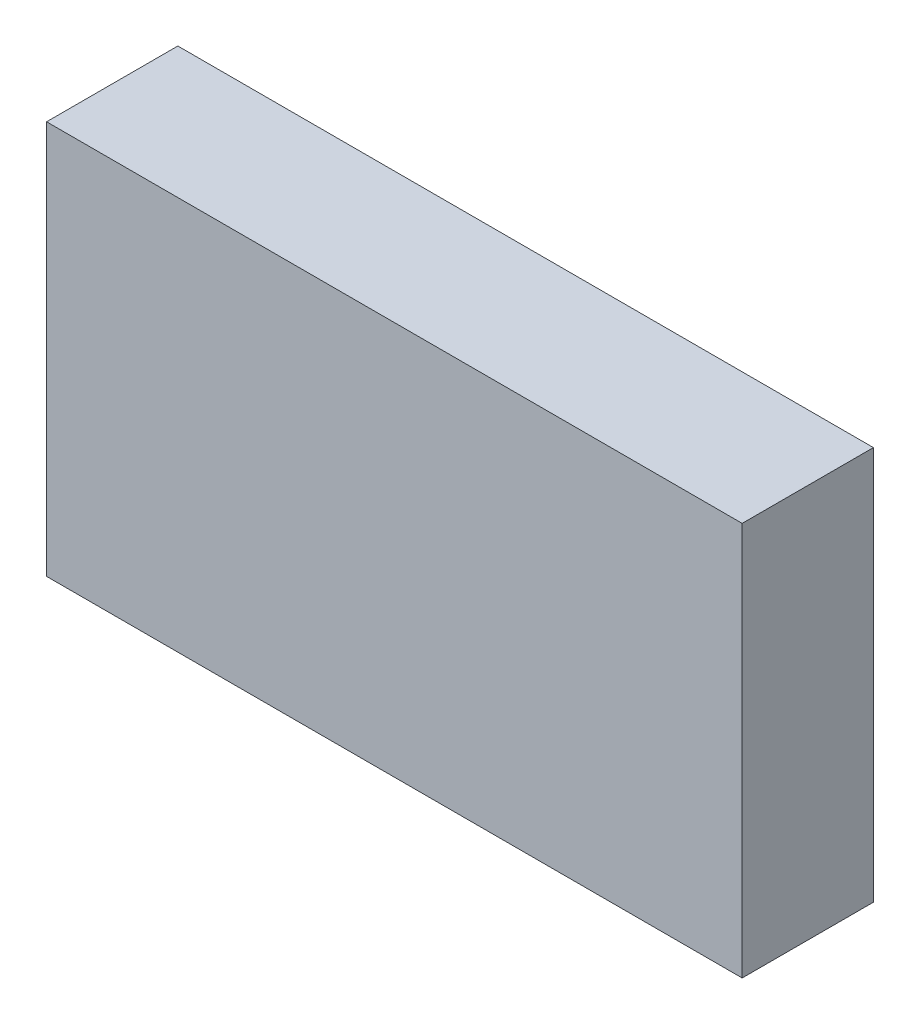
ISO-10303-21;
HEADER;
FILE_DESCRIPTION(('STEP AP214'),'2;1');
FILE_NAME('part.step','',(''),(''),'','','');
FILE_SCHEMA(('AUTOMOTIVE_DESIGN { 1 0 10303 214 1 1 1 1 }'));
ENDSEC;
DATA;
#1=APPLICATION_CONTEXT('core data for automotive mechanical design processes');
#2=APPLICATION_PROTOCOL_DEFINITION('international standard','automotive_design',2000,#1);
#3=PRODUCT_CONTEXT('',#1,'mechanical');
#4=PRODUCT('Part','Part','',(#3));
#5=PRODUCT_RELATED_PRODUCT_CATEGORY('part','',(#4));
#6=PRODUCT_DEFINITION_FORMATION('','',#4);
#7=PRODUCT_DEFINITION_CONTEXT('part definition',#1,'design');
#8=PRODUCT_DEFINITION('design','',#6,#7);
#9=PRODUCT_DEFINITION_SHAPE('','',#8);
#10=(LENGTH_UNIT() NAMED_UNIT(*) SI_UNIT(.MILLI.,.METRE.));
#11=(NAMED_UNIT(*) PLANE_ANGLE_UNIT() SI_UNIT($,.RADIAN.));
#12=(NAMED_UNIT(*) SI_UNIT($,.STERADIAN.) SOLID_ANGLE_UNIT());
#13=UNCERTAINTY_MEASURE_WITH_UNIT(LENGTH_MEASURE(1.E-05),#10,'distance_accuracy_value','');
#14=(GEOMETRIC_REPRESENTATION_CONTEXT(3) GLOBAL_UNCERTAINTY_ASSIGNED_CONTEXT((#13)) GLOBAL_UNIT_ASSIGNED_CONTEXT((#10,
#11,#12)) REPRESENTATION_CONTEXT('',''));
#15=CARTESIAN_POINT('',(0.,0.,0.));
#16=DIRECTION('',(0.,0.,1.));
#17=DIRECTION('',(1.,0.,0.));
#18=AXIS2_PLACEMENT_3D('',#15,#16,#17);
#19=CARTESIAN_POINT('',(26.5,15.,10.));
#20=DIRECTION('',(-1.,0.,0.));
#21=DIRECTION('',(0.,0.,1.));
#22=AXIS2_PLACEMENT_3D('',#19,#20,#21);
#23=PLANE('',#22);
#24=DIRECTION('',(0.,1.,0.));
#25=VECTOR('',#24,1.);
#26=CARTESIAN_POINT('',(26.5,15.,0.));
#27=LINE('',#26,#25);
#28=CARTESIAN_POINT('',(26.5,-15.,0.));
#29=VERTEX_POINT('',#28);
#30=CARTESIAN_POINT('',(26.5,15.,0.));
#31=VERTEX_POINT('',#30);
#32=EDGE_CURVE('E111',#29,#31,#27,.T.);
#33=ORIENTED_EDGE('',*,*,#32,.T.);
#34=DIRECTION('',(0.,0.,-1.));
#35=VECTOR('',#34,1.);
#36=CARTESIAN_POINT('',(26.5,15.,10.));
#37=LINE('',#36,#35);
#38=CARTESIAN_POINT('',(26.5,15.,10.));
#39=VERTEX_POINT('',#38);
#40=EDGE_CURVE('E11',#39,#31,#37,.T.);
#41=ORIENTED_EDGE('',*,*,#40,.F.);
#42=DIRECTION('',(0.,1.,0.));
#43=VECTOR('',#42,1.);
#44=CARTESIAN_POINT('',(26.5,15.,10.));
#45=LINE('',#44,#43);
#46=CARTESIAN_POINT('',(26.5,-15.,10.));
#47=VERTEX_POINT('',#46);
#48=EDGE_CURVE('E95',#47,#39,#45,.T.);
#49=ORIENTED_EDGE('',*,*,#48,.F.);
#50=DIRECTION('',(0.,0.,-1.));
#51=VECTOR('',#50,1.);
#52=CARTESIAN_POINT('',(26.5,-15.,10.));
#53=LINE('',#52,#51);
#54=EDGE_CURVE('E107',#47,#29,#53,.T.);
#55=ORIENTED_EDGE('',*,*,#54,.T.);
#56=EDGE_LOOP('',(#33,#41,#49,#55));
#57=FACE_BOUND('',#56,.T.);
#58=ADVANCED_FACE('F43',(#57),#23,.F.);
#59=CARTESIAN_POINT('',(-26.5,15.,10.));
#60=DIRECTION('',(0.,-1.,0.));
#61=DIRECTION('',(0.,0.,-1.));
#62=AXIS2_PLACEMENT_3D('',#59,#60,#61);
#63=PLANE('',#62);
#64=DIRECTION('',(-1.,0.,0.));
#65=VECTOR('',#64,1.);
#66=CARTESIAN_POINT('',(-26.5,15.,0.));
#67=LINE('',#66,#65);
#68=CARTESIAN_POINT('',(-26.5,15.,0.));
#69=VERTEX_POINT('',#68);
#70=EDGE_CURVE('E100',#31,#69,#67,.T.);
#71=ORIENTED_EDGE('',*,*,#70,.T.);
#72=DIRECTION('',(0.,0.,-1.));
#73=VECTOR('',#72,1.);
#74=CARTESIAN_POINT('',(-26.5,15.,10.));
#75=LINE('',#74,#73);
#76=CARTESIAN_POINT('',(-26.5,15.,10.));
#77=VERTEX_POINT('',#76);
#78=EDGE_CURVE('E52',#77,#69,#75,.T.);
#79=ORIENTED_EDGE('',*,*,#78,.F.);
#80=DIRECTION('',(-1.,0.,0.));
#81=VECTOR('',#80,1.);
#82=CARTESIAN_POINT('',(-26.5,15.,10.));
#83=LINE('',#82,#81);
#84=EDGE_CURVE('E90',#39,#77,#83,.T.);
#85=ORIENTED_EDGE('',*,*,#84,.F.);
#86=ORIENTED_EDGE('',*,*,#40,.T.);
#87=EDGE_LOOP('',(#71,#79,#85,#86));
#88=FACE_BOUND('',#87,.T.);
#89=ADVANCED_FACE('F99',(#88),#63,.F.);
#90=CARTESIAN_POINT('',(-26.5,15.,10.));
#91=DIRECTION('',(1.,0.,0.));
#92=DIRECTION('',(0.,0.,-1.));
#93=AXIS2_PLACEMENT_3D('',#90,#91,#92);
#94=PLANE('',#93);
#95=DIRECTION('',(0.,-1.,0.));
#96=VECTOR('',#95,1.);
#97=CARTESIAN_POINT('',(-26.5,15.,0.));
#98=LINE('',#97,#96);
#99=CARTESIAN_POINT('',(-26.5,-15.,0.));
#100=VERTEX_POINT('',#99);
#101=EDGE_CURVE('E77',#69,#100,#98,.T.);
#102=ORIENTED_EDGE('',*,*,#101,.T.);
#103=DIRECTION('',(0.,0.,-1.));
#104=VECTOR('',#103,1.);
#105=CARTESIAN_POINT('',(-26.5,-15.,10.));
#106=LINE('',#105,#104);
#107=CARTESIAN_POINT('',(-26.5,-15.,10.));
#108=VERTEX_POINT('',#107);
#109=EDGE_CURVE('E102',#108,#100,#106,.T.);
#110=ORIENTED_EDGE('',*,*,#109,.F.);
#111=DIRECTION('',(0.,-1.,0.));
#112=VECTOR('',#111,1.);
#113=CARTESIAN_POINT('',(-26.5,15.,10.));
#114=LINE('',#113,#112);
#115=EDGE_CURVE('E93',#77,#108,#114,.T.);
#116=ORIENTED_EDGE('',*,*,#115,.F.);
#117=ORIENTED_EDGE('',*,*,#78,.T.);
#118=EDGE_LOOP('',(#102,#110,#116,#117));
#119=FACE_BOUND('',#118,.T.);
#120=ADVANCED_FACE('F103',(#119),#94,.F.);
#121=CARTESIAN_POINT('',(-26.5,-15.,10.));
#122=DIRECTION('',(0.,1.,0.));
#123=DIRECTION('',(0.,0.,1.));
#124=AXIS2_PLACEMENT_3D('',#121,#122,#123);
#125=PLANE('',#124);
#126=DIRECTION('',(1.,0.,0.));
#127=VECTOR('',#126,1.);
#128=CARTESIAN_POINT('',(-26.5,-15.,0.));
#129=LINE('',#128,#127);
#130=EDGE_CURVE('E83',#100,#29,#129,.T.);
#131=ORIENTED_EDGE('',*,*,#130,.T.);
#132=ORIENTED_EDGE('',*,*,#54,.F.);
#133=DIRECTION('',(1.,0.,0.));
#134=VECTOR('',#133,1.);
#135=CARTESIAN_POINT('',(-26.5,-15.,10.));
#136=LINE('',#135,#134);
#137=EDGE_CURVE('E60',#108,#47,#136,.T.);
#138=ORIENTED_EDGE('',*,*,#137,.F.);
#139=ORIENTED_EDGE('',*,*,#109,.T.);
#140=EDGE_LOOP('',(#131,#132,#138,#139));
#141=FACE_BOUND('',#140,.T.);
#142=ADVANCED_FACE('F124',(#141),#125,.F.);
#143=CARTESIAN_POINT('',(0.,0.,10.));
#144=DIRECTION('',(0.,0.,1.));
#145=DIRECTION('',(1.,0.,0.));
#146=AXIS2_PLACEMENT_3D('',#143,#144,#145);
#147=PLANE('',#146);
#148=ORIENTED_EDGE('',*,*,#48,.T.);
#149=ORIENTED_EDGE('',*,*,#84,.T.);
#150=ORIENTED_EDGE('',*,*,#115,.T.);
#151=ORIENTED_EDGE('',*,*,#137,.T.);
#152=EDGE_LOOP('',(#148,#149,#150,#151));
#153=FACE_BOUND('',#152,.T.);
#154=ADVANCED_FACE('F91',(#153),#147,.T.);
#155=CARTESIAN_POINT('',(0.,0.,0.));
#156=DIRECTION('',(0.,0.,1.));
#157=DIRECTION('',(1.,0.,0.));
#158=AXIS2_PLACEMENT_3D('',#155,#156,#157);
#159=PLANE('',#158);
#160=ORIENTED_EDGE('',*,*,#32,.F.);
#161=ORIENTED_EDGE('',*,*,#130,.F.);
#162=ORIENTED_EDGE('',*,*,#101,.F.);
#163=ORIENTED_EDGE('',*,*,#70,.F.);
#164=EDGE_LOOP('',(#160,#161,#162,#163));
#165=FACE_BOUND('',#164,.T.);
#166=ADVANCED_FACE('F127',(#165),#159,.F.);
#167=CLOSED_SHELL('',(#58,#89,#120,#142,#154,#166));
#168=MANIFOLD_SOLID_BREP('B2',#167);
#169=ADVANCED_BREP_SHAPE_REPRESENTATION('',(#18,#168),#14);
#170=SHAPE_DEFINITION_REPRESENTATION(#9,#169);
ENDSEC;
END-ISO-10303-21;
